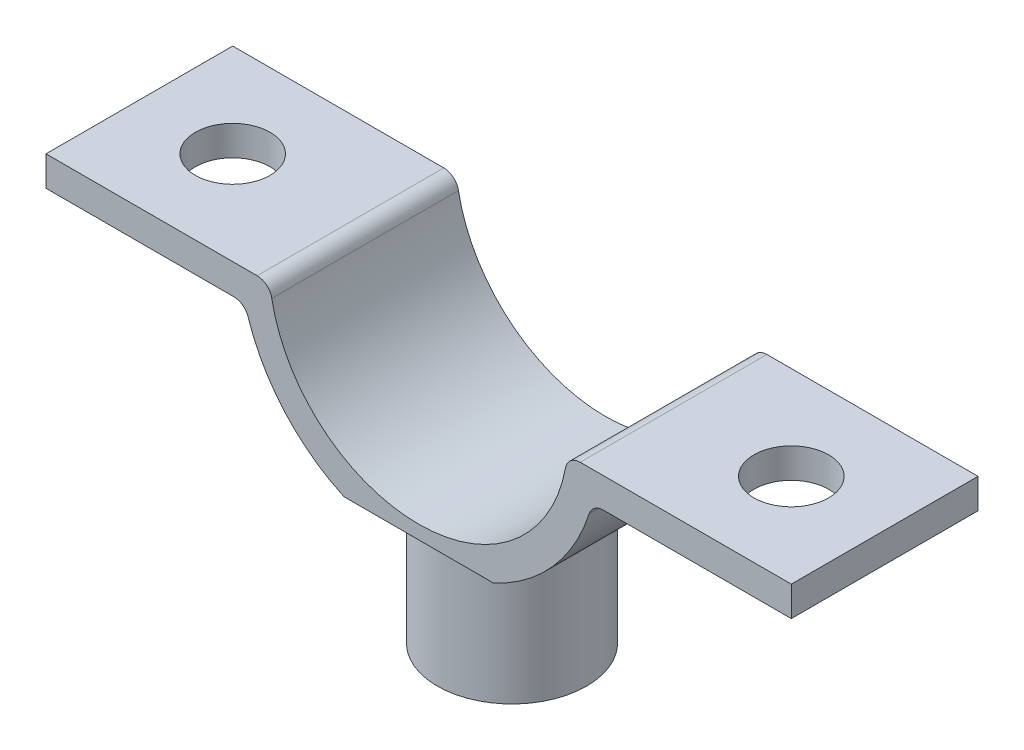
ISO-10303-21;
HEADER;
FILE_DESCRIPTION(('STEP AP214'),'2;1');
FILE_NAME('part.step','',(''),(''),'','','');
FILE_SCHEMA(('AUTOMOTIVE_DESIGN { 1 0 10303 214 1 1 1 1 }'));
ENDSEC;
DATA;
#1=APPLICATION_CONTEXT('core data for automotive mechanical design processes');
#2=APPLICATION_PROTOCOL_DEFINITION('international standard','automotive_design',2000,#1);
#3=PRODUCT_CONTEXT('',#1,'mechanical');
#4=PRODUCT('Part','Part','',(#3));
#5=PRODUCT_RELATED_PRODUCT_CATEGORY('part','',(#4));
#6=PRODUCT_DEFINITION_FORMATION('','',#4);
#7=PRODUCT_DEFINITION_CONTEXT('part definition',#1,'design');
#8=PRODUCT_DEFINITION('design','',#6,#7);
#9=PRODUCT_DEFINITION_SHAPE('','',#8);
#10=(LENGTH_UNIT() NAMED_UNIT(*) SI_UNIT(.MILLI.,.METRE.));
#11=(NAMED_UNIT(*) PLANE_ANGLE_UNIT() SI_UNIT($,.RADIAN.));
#12=(NAMED_UNIT(*) SI_UNIT($,.STERADIAN.) SOLID_ANGLE_UNIT());
#13=UNCERTAINTY_MEASURE_WITH_UNIT(LENGTH_MEASURE(1.E-05),#10,'distance_accuracy_value','');
#14=(GEOMETRIC_REPRESENTATION_CONTEXT(3) GLOBAL_UNCERTAINTY_ASSIGNED_CONTEXT((#13)) GLOBAL_UNIT_ASSIGNED_CONTEXT((#10,
#11,#12)) REPRESENTATION_CONTEXT('',''));
#15=CARTESIAN_POINT('',(0.,0.,0.));
#16=DIRECTION('',(0.,0.,1.));
#17=DIRECTION('',(1.,0.,0.));
#18=AXIS2_PLACEMENT_3D('',#15,#16,#17);
#19=CARTESIAN_POINT('',(12.369316876853,16.0173195198486,12.5));
#20=DIRECTION('',(0.,0.,-1.));
#21=DIRECTION('',(-1.,0.,0.));
#22=AXIS2_PLACEMENT_3D('',#19,#20,#21);
#23=CYLINDRICAL_SURFACE('',#22,1.);
#24=CARTESIAN_POINT('',(12.369316876853,16.0173195198486,0.));
#25=DIRECTION('',(0.,0.,-1.));
#26=DIRECTION('',(1.,0.,0.));
#27=AXIS2_PLACEMENT_3D('',#24,#25,#26);
#28=CIRCLE('',#27,1.);
#29=CARTESIAN_POINT('',(11.4178309632489,16.3250118275409,0.));
#30=VERTEX_POINT('',#29);
#31=CARTESIAN_POINT('',(12.369316876853,17.0173195198486,0.));
#32=VERTEX_POINT('',#31);
#33=EDGE_CURVE('E158',#30,#32,#28,.T.);
#34=ORIENTED_EDGE('',*,*,#33,.T.);
#35=DIRECTION('',(0.,0.,-1.));
#36=VECTOR('',#35,1.);
#37=CARTESIAN_POINT('',(12.369316876853,17.0173195198486,12.5));
#38=LINE('',#37,#36);
#39=CARTESIAN_POINT('',(12.369316876853,17.0173195198486,12.5));
#40=VERTEX_POINT('',#39);
#41=EDGE_CURVE('E156',#40,#32,#38,.T.);
#42=ORIENTED_EDGE('',*,*,#41,.F.);
#43=CARTESIAN_POINT('',(12.369316876853,16.0173195198486,12.5));
#44=DIRECTION('',(0.,0.,-1.));
#45=DIRECTION('',(1.,0.,0.));
#46=AXIS2_PLACEMENT_3D('',#43,#44,#45);
#47=CIRCLE('',#46,1.);
#48=CARTESIAN_POINT('',(11.4178309632489,16.3250118275409,12.5));
#49=VERTEX_POINT('',#48);
#50=EDGE_CURVE('E140',#49,#40,#47,.T.);
#51=ORIENTED_EDGE('',*,*,#50,.F.);
#52=DIRECTION('',(0.,0.,-1.));
#53=VECTOR('',#52,1.);
#54=CARTESIAN_POINT('',(11.4178309632489,16.3250118275409,12.5));
#55=LINE('',#54,#53);
#56=EDGE_CURVE('E160',#49,#30,#55,.T.);
#57=ORIENTED_EDGE('',*,*,#56,.T.);
#58=EDGE_LOOP('',(#34,#42,#51,#57));
#59=FACE_BOUND('',#58,.T.);
#60=ADVANCED_FACE('F38',(#59),#23,.F.);
#61=CARTESIAN_POINT('',(24.9498743710662,17.0173195198486,12.5));
#62=DIRECTION('',(0.,1.,0.));
#63=DIRECTION('',(0.,0.,1.));
#64=AXIS2_PLACEMENT_3D('',#61,#62,#63);
#65=PLANE('',#64);
#66=CARTESIAN_POINT('',(18.6998743710662,17.0173195198486,6.25));
#67=DIRECTION('',(0.,1.,0.));
#68=DIRECTION('',(0.,0.,1.));
#69=AXIS2_PLACEMENT_3D('',#66,#67,#68);
#70=CIRCLE('',#69,2.5);
#71=CARTESIAN_POINT('',(18.6998743710662,17.0173195198486,8.75));
#72=VERTEX_POINT('',#71);
#73=EDGE_CURVE('E283',#72,#72,#70,.F.);
#74=ORIENTED_EDGE('',*,*,#73,.F.);
#75=EDGE_LOOP('',(#74));
#76=FACE_BOUND('',#75,.T.);
#77=DIRECTION('',(1.,0.,0.));
#78=VECTOR('',#77,1.);
#79=CARTESIAN_POINT('',(24.9498743710662,17.0173195198486,0.));
#80=LINE('',#79,#78);
#81=CARTESIAN_POINT('',(24.9498743710662,17.0173195198486,0.));
#82=VERTEX_POINT('',#81);
#83=EDGE_CURVE('E194',#32,#82,#80,.T.);
#84=ORIENTED_EDGE('',*,*,#83,.T.);
#85=DIRECTION('',(0.,0.,-1.));
#86=VECTOR('',#85,1.);
#87=CARTESIAN_POINT('',(24.9498743710662,17.0173195198486,12.5));
#88=LINE('',#87,#86);
#89=CARTESIAN_POINT('',(24.9498743710662,17.0173195198486,12.5));
#90=VERTEX_POINT('',#89);
#91=EDGE_CURVE('E161',#90,#82,#88,.T.);
#92=ORIENTED_EDGE('',*,*,#91,.F.);
#93=DIRECTION('',(1.,0.,0.));
#94=VECTOR('',#93,1.);
#95=CARTESIAN_POINT('',(19.9498743710662,17.0173195198486,12.5));
#96=LINE('',#95,#94);
#97=EDGE_CURVE('E145',#40,#90,#96,.T.);
#98=ORIENTED_EDGE('',*,*,#97,.F.);
#99=ORIENTED_EDGE('',*,*,#41,.T.);
#100=EDGE_LOOP('',(#84,#92,#98,#99));
#101=FACE_BOUND('',#100,.T.);
#102=ADVANCED_FACE('F163',(#76,#101),#65,.F.);
#103=CARTESIAN_POINT('',(24.9498743710662,19.0173195198486,12.5));
#104=DIRECTION('',(-1.,0.,0.));
#105=DIRECTION('',(0.,0.,1.));
#106=AXIS2_PLACEMENT_3D('',#103,#104,#105);
#107=PLANE('',#106);
#108=DIRECTION('',(0.,1.,0.));
#109=VECTOR('',#108,1.);
#110=CARTESIAN_POINT('',(24.9498743710662,19.0173195198486,0.));
#111=LINE('',#110,#109);
#112=CARTESIAN_POINT('',(24.9498743710662,19.0173195198486,0.));
#113=VERTEX_POINT('',#112);
#114=EDGE_CURVE('E196',#82,#113,#111,.T.);
#115=ORIENTED_EDGE('',*,*,#114,.T.);
#116=DIRECTION('',(0.,0.,-1.));
#117=VECTOR('',#116,1.);
#118=CARTESIAN_POINT('',(24.9498743710662,19.0173195198486,12.5));
#119=LINE('',#118,#117);
#120=CARTESIAN_POINT('',(24.9498743710662,19.0173195198486,12.5));
#121=VERTEX_POINT('',#120);
#122=EDGE_CURVE('E166',#121,#113,#119,.T.);
#123=ORIENTED_EDGE('',*,*,#122,.F.);
#124=DIRECTION('',(0.,1.,0.));
#125=VECTOR('',#124,1.);
#126=CARTESIAN_POINT('',(24.9498743710662,19.0173195198486,12.5));
#127=LINE('',#126,#125);
#128=EDGE_CURVE('E61',#90,#121,#127,.T.);
#129=ORIENTED_EDGE('',*,*,#128,.F.);
#130=ORIENTED_EDGE('',*,*,#91,.T.);
#131=EDGE_LOOP('',(#115,#123,#129,#130));
#132=FACE_BOUND('',#131,.T.);
#133=ADVANCED_FACE('F330',(#132),#107,.F.);
#134=CARTESIAN_POINT('',(10.816653826392,19.0173195198486,12.5));
#135=DIRECTION('',(0.,-1.,0.));
#136=DIRECTION('',(0.,0.,-1.));
#137=AXIS2_PLACEMENT_3D('',#134,#135,#136);
#138=PLANE('',#137);
#139=CARTESIAN_POINT('',(18.6998743710661,19.0173195198487,6.25));
#140=DIRECTION('',(0.,1.,0.));
#141=DIRECTION('',(1.,0.,0.));
#142=AXIS2_PLACEMENT_3D('',#139,#140,#141);
#143=CIRCLE('',#142,2.5);
#144=CARTESIAN_POINT('',(21.1998743710662,19.0173195198487,6.25));
#145=VERTEX_POINT('',#144);
#146=EDGE_CURVE('E287',#145,#145,#143,.T.);
#147=ORIENTED_EDGE('',*,*,#146,.F.);
#148=EDGE_LOOP('',(#147));
#149=FACE_BOUND('',#148,.T.);
#150=DIRECTION('',(-1.,0.,0.));
#151=VECTOR('',#150,1.);
#152=CARTESIAN_POINT('',(10.816653826392,19.0173195198486,0.));
#153=LINE('',#152,#151);
#154=CARTESIAN_POINT('',(10.816653826392,19.0173195198486,0.));
#155=VERTEX_POINT('',#154);
#156=EDGE_CURVE('E106',#113,#155,#153,.T.);
#157=ORIENTED_EDGE('',*,*,#156,.T.);
#158=DIRECTION('',(0.,0.,-1.));
#159=VECTOR('',#158,1.);
#160=CARTESIAN_POINT('',(10.816653826392,19.0173195198486,12.5));
#161=LINE('',#160,#159);
#162=CARTESIAN_POINT('',(10.816653826392,19.0173195198486,12.5));
#163=VERTEX_POINT('',#162);
#164=EDGE_CURVE('E46',#163,#155,#161,.T.);
#165=ORIENTED_EDGE('',*,*,#164,.F.);
#166=DIRECTION('',(-1.,0.,0.));
#167=VECTOR('',#166,1.);
#168=CARTESIAN_POINT('',(19.9498743710662,19.0173195198486,12.5));
#169=LINE('',#168,#167);
#170=EDGE_CURVE('E112',#121,#163,#169,.T.);
#171=ORIENTED_EDGE('',*,*,#170,.F.);
#172=ORIENTED_EDGE('',*,*,#122,.T.);
#173=EDGE_LOOP('',(#157,#165,#171,#172));
#174=FACE_BOUND('',#173,.T.);
#175=ADVANCED_FACE('F40',(#149,#174),#138,.F.);
#176=CARTESIAN_POINT('',(10.816653826392,18.0173195198486,12.5));
#177=DIRECTION('',(0.,0.,-1.));
#178=DIRECTION('',(-1.,0.,0.));
#179=AXIS2_PLACEMENT_3D('',#176,#177,#178);
#180=CYLINDRICAL_SURFACE('',#179,1.);
#181=CARTESIAN_POINT('',(10.816653826392,18.0173195198486,0.));
#182=DIRECTION('',(0.,0.,1.));
#183=DIRECTION('',(1.,0.,0.));
#184=AXIS2_PLACEMENT_3D('',#181,#182,#183);
#185=CIRCLE('',#184,1.);
#186=CARTESIAN_POINT('',(9.83332166035634,18.1991377016668,0.));
#187=VERTEX_POINT('',#186);
#188=EDGE_CURVE('E171',#155,#187,#185,.T.);
#189=ORIENTED_EDGE('',*,*,#188,.T.);
#190=DIRECTION('',(0.,0.,-1.));
#191=VECTOR('',#190,1.);
#192=CARTESIAN_POINT('',(9.83332166035634,18.1991377016668,12.5));
#193=LINE('',#192,#191);
#194=CARTESIAN_POINT('',(9.83332166035634,18.1991377016668,12.5));
#195=VERTEX_POINT('',#194);
#196=EDGE_CURVE('E220',#195,#187,#193,.T.);
#197=ORIENTED_EDGE('',*,*,#196,.F.);
#198=CARTESIAN_POINT('',(10.816653826392,18.0173195198486,12.5));
#199=DIRECTION('',(0.,0.,1.));
#200=DIRECTION('',(1.,0.,0.));
#201=AXIS2_PLACEMENT_3D('',#198,#199,#200);
#202=CIRCLE('',#201,1.);
#203=EDGE_CURVE('E227',#163,#195,#202,.T.);
#204=ORIENTED_EDGE('',*,*,#203,.F.);
#205=ORIENTED_EDGE('',*,*,#164,.T.);
#206=EDGE_LOOP('',(#189,#197,#204,#205));
#207=FACE_BOUND('',#206,.T.);
#208=ADVANCED_FACE('F225',(#207),#180,.T.);
#209=CARTESIAN_POINT('',(0.,20.0173195198486,12.5));
#210=DIRECTION('',(0.,0.,-1.));
#211=DIRECTION('',(-1.,0.,0.));
#212=AXIS2_PLACEMENT_3D('',#209,#210,#211);
#213=CYLINDRICAL_SURFACE('',#212,10.);
#214=CARTESIAN_POINT('',(0.,20.0173195198486,0.));
#215=DIRECTION('',(0.,0.,-1.));
#216=DIRECTION('',(1.,0.,0.));
#217=AXIS2_PLACEMENT_3D('',#214,#215,#216);
#218=CIRCLE('',#217,10.);
#219=CARTESIAN_POINT('',(-9.83332166035634,18.1991377016668,0.));
#220=VERTEX_POINT('',#219);
#221=EDGE_CURVE('E174',#187,#220,#218,.T.);
#222=ORIENTED_EDGE('',*,*,#221,.T.);
#223=DIRECTION('',(0.,0.,-1.));
#224=VECTOR('',#223,1.);
#225=CARTESIAN_POINT('',(-9.83332166035634,18.1991377016668,12.5));
#226=LINE('',#225,#224);
#227=CARTESIAN_POINT('',(-9.83332166035634,18.1991377016668,12.5));
#228=VERTEX_POINT('',#227);
#229=EDGE_CURVE('E217',#228,#220,#226,.T.);
#230=ORIENTED_EDGE('',*,*,#229,.F.);
#231=CARTESIAN_POINT('',(0.,20.0173195198486,12.5));
#232=DIRECTION('',(0.,0.,-1.));
#233=DIRECTION('',(1.,0.,0.));
#234=AXIS2_PLACEMENT_3D('',#231,#232,#233);
#235=CIRCLE('',#234,10.);
#236=EDGE_CURVE('E243',#195,#228,#235,.T.);
#237=ORIENTED_EDGE('',*,*,#236,.F.);
#238=ORIENTED_EDGE('',*,*,#196,.T.);
#239=EDGE_LOOP('',(#222,#230,#237,#238));
#240=FACE_BOUND('',#239,.T.);
#241=ADVANCED_FACE('F234',(#240),#213,.F.);
#242=CARTESIAN_POINT('',(-10.816653826392,18.0173195198486,12.5));
#243=DIRECTION('',(0.,0.,-1.));
#244=DIRECTION('',(-1.,0.,0.));
#245=AXIS2_PLACEMENT_3D('',#242,#243,#244);
#246=CYLINDRICAL_SURFACE('',#245,1.);
#247=CARTESIAN_POINT('',(-10.816653826392,18.0173195198486,0.));
#248=DIRECTION('',(0.,0.,1.));
#249=DIRECTION('',(-1.,0.,0.));
#250=AXIS2_PLACEMENT_3D('',#247,#248,#249);
#251=CIRCLE('',#250,1.);
#252=CARTESIAN_POINT('',(-10.816653826392,19.0173195198486,0.));
#253=VERTEX_POINT('',#252);
#254=EDGE_CURVE('E176',#220,#253,#251,.T.);
#255=ORIENTED_EDGE('',*,*,#254,.T.);
#256=DIRECTION('',(0.,0.,-1.));
#257=VECTOR('',#256,1.);
#258=CARTESIAN_POINT('',(-10.816653826392,19.0173195198486,12.5));
#259=LINE('',#258,#257);
#260=CARTESIAN_POINT('',(-10.816653826392,19.0173195198486,12.5));
#261=VERTEX_POINT('',#260);
#262=EDGE_CURVE('E214',#261,#253,#259,.T.);
#263=ORIENTED_EDGE('',*,*,#262,.F.);
#264=CARTESIAN_POINT('',(-10.816653826392,18.0173195198486,12.5));
#265=DIRECTION('',(0.,0.,1.));
#266=DIRECTION('',(-1.,0.,0.));
#267=AXIS2_PLACEMENT_3D('',#264,#265,#266);
#268=CIRCLE('',#267,1.);
#269=EDGE_CURVE('E240',#228,#261,#268,.T.);
#270=ORIENTED_EDGE('',*,*,#269,.F.);
#271=ORIENTED_EDGE('',*,*,#229,.T.);
#272=EDGE_LOOP('',(#255,#263,#270,#271));
#273=FACE_BOUND('',#272,.T.);
#274=ADVANCED_FACE('F238',(#273),#246,.T.);
#275=CARTESIAN_POINT('',(-19.9498743710662,19.0173195198486,12.5));
#276=DIRECTION('',(0.,-1.,0.));
#277=DIRECTION('',(1.,0.,0.));
#278=AXIS2_PLACEMENT_3D('',#275,#276,#277);
#279=PLANE('',#278);
#280=CARTESIAN_POINT('',(-18.6998743710662,19.0173195198486,6.25));
#281=DIRECTION('',(0.,1.,0.));
#282=DIRECTION('',(-1.,0.,0.));
#283=AXIS2_PLACEMENT_3D('',#280,#281,#282);
#284=CIRCLE('',#283,2.5);
#285=CARTESIAN_POINT('',(-21.1998743710662,19.0173195198486,6.25));
#286=VERTEX_POINT('',#285);
#287=EDGE_CURVE('E286',#286,#286,#284,.T.);
#288=ORIENTED_EDGE('',*,*,#287,.F.);
#289=EDGE_LOOP('',(#288));
#290=FACE_BOUND('',#289,.T.);
#291=DIRECTION('',(-1.,0.,0.));
#292=VECTOR('',#291,1.);
#293=CARTESIAN_POINT('',(-19.9498743710662,19.0173195198486,0.));
#294=LINE('',#293,#292);
#295=CARTESIAN_POINT('',(-24.9498743710662,19.0173195198486,0.));
#296=VERTEX_POINT('',#295);
#297=EDGE_CURVE('E179',#253,#296,#294,.T.);
#298=ORIENTED_EDGE('',*,*,#297,.T.);
#299=DIRECTION('',(0.,0.,-1.));
#300=VECTOR('',#299,1.);
#301=CARTESIAN_POINT('',(-24.9498743710662,19.0173195198486,12.5));
#302=LINE('',#301,#300);
#303=CARTESIAN_POINT('',(-24.9498743710662,19.0173195198486,12.5));
#304=VERTEX_POINT('',#303);
#305=EDGE_CURVE('E211',#304,#296,#302,.T.);
#306=ORIENTED_EDGE('',*,*,#305,.F.);
#307=DIRECTION('',(-1.,0.,0.));
#308=VECTOR('',#307,1.);
#309=CARTESIAN_POINT('',(-10.816653826392,19.0173195198486,12.5));
#310=LINE('',#309,#308);
#311=EDGE_CURVE('E242',#261,#304,#310,.T.);
#312=ORIENTED_EDGE('',*,*,#311,.F.);
#313=ORIENTED_EDGE('',*,*,#262,.T.);
#314=EDGE_LOOP('',(#298,#306,#312,#313));
#315=FACE_BOUND('',#314,.T.);
#316=ADVANCED_FACE('F298',(#290,#315),#279,.F.);
#317=CARTESIAN_POINT('',(-24.9498743710662,19.0173195198486,12.5));
#318=DIRECTION('',(1.,0.,0.));
#319=DIRECTION('',(0.,0.,-1.));
#320=AXIS2_PLACEMENT_3D('',#317,#318,#319);
#321=PLANE('',#320);
#322=DIRECTION('',(0.,-1.,0.));
#323=VECTOR('',#322,1.);
#324=CARTESIAN_POINT('',(-24.9498743710662,19.0173195198486,0.));
#325=LINE('',#324,#323);
#326=CARTESIAN_POINT('',(-24.9498743710662,17.0173195198486,0.));
#327=VERTEX_POINT('',#326);
#328=EDGE_CURVE('E181',#296,#327,#325,.T.);
#329=ORIENTED_EDGE('',*,*,#328,.T.);
#330=DIRECTION('',(0.,0.,-1.));
#331=VECTOR('',#330,1.);
#332=CARTESIAN_POINT('',(-24.9498743710662,17.0173195198486,12.5));
#333=LINE('',#332,#331);
#334=CARTESIAN_POINT('',(-24.9498743710662,17.0173195198486,12.5));
#335=VERTEX_POINT('',#334);
#336=EDGE_CURVE('E208',#335,#327,#333,.T.);
#337=ORIENTED_EDGE('',*,*,#336,.F.);
#338=DIRECTION('',(0.,-1.,0.));
#339=VECTOR('',#338,1.);
#340=CARTESIAN_POINT('',(-24.9498743710662,19.0173195198486,12.5));
#341=LINE('',#340,#339);
#342=EDGE_CURVE('E245',#304,#335,#341,.T.);
#343=ORIENTED_EDGE('',*,*,#342,.F.);
#344=ORIENTED_EDGE('',*,*,#305,.T.);
#345=EDGE_LOOP('',(#329,#337,#343,#344));
#346=FACE_BOUND('',#345,.T.);
#347=ADVANCED_FACE('F301',(#346),#321,.F.);
#348=CARTESIAN_POINT('',(-19.9498743710662,17.0173195198486,12.5));
#349=DIRECTION('',(0.,1.,0.));
#350=DIRECTION('',(0.,0.,1.));
#351=AXIS2_PLACEMENT_3D('',#348,#349,#350);
#352=PLANE('',#351);
#353=CARTESIAN_POINT('',(-18.6998743710662,17.0173195198486,6.25));
#354=DIRECTION('',(0.,1.,0.));
#355=DIRECTION('',(0.,0.,1.));
#356=AXIS2_PLACEMENT_3D('',#353,#354,#355);
#357=CIRCLE('',#356,2.5);
#358=CARTESIAN_POINT('',(-18.6998743710662,17.0173195198486,8.75));
#359=VERTEX_POINT('',#358);
#360=EDGE_CURVE('E280',#359,#359,#357,.F.);
#361=ORIENTED_EDGE('',*,*,#360,.F.);
#362=EDGE_LOOP('',(#361));
#363=FACE_BOUND('',#362,.T.);
#364=DIRECTION('',(1.,0.,0.));
#365=VECTOR('',#364,1.);
#366=CARTESIAN_POINT('',(-19.9498743710662,17.0173195198486,0.));
#367=LINE('',#366,#365);
#368=CARTESIAN_POINT('',(-12.369316876853,17.0173195198486,0.));
#369=VERTEX_POINT('',#368);
#370=EDGE_CURVE('E184',#327,#369,#367,.T.);
#371=ORIENTED_EDGE('',*,*,#370,.T.);
#372=DIRECTION('',(0.,0.,-1.));
#373=VECTOR('',#372,1.);
#374=CARTESIAN_POINT('',(-12.369316876853,17.0173195198486,12.5));
#375=LINE('',#374,#373);
#376=CARTESIAN_POINT('',(-12.369316876853,17.0173195198486,12.5));
#377=VERTEX_POINT('',#376);
#378=EDGE_CURVE('E205',#377,#369,#375,.T.);
#379=ORIENTED_EDGE('',*,*,#378,.F.);
#380=DIRECTION('',(1.,0.,0.));
#381=VECTOR('',#380,1.);
#382=CARTESIAN_POINT('',(-24.9498743710662,17.0173195198486,12.5));
#383=LINE('',#382,#381);
#384=EDGE_CURVE('E251',#335,#377,#383,.T.);
#385=ORIENTED_EDGE('',*,*,#384,.F.);
#386=ORIENTED_EDGE('',*,*,#336,.T.);
#387=EDGE_LOOP('',(#371,#379,#385,#386));
#388=FACE_BOUND('',#387,.T.);
#389=ADVANCED_FACE('F311',(#363,#388),#352,.F.);
#390=CARTESIAN_POINT('',(-12.369316876853,16.0173195198486,12.5));
#391=DIRECTION('',(0.,0.,-1.));
#392=DIRECTION('',(-1.,0.,0.));
#393=AXIS2_PLACEMENT_3D('',#390,#391,#392);
#394=CYLINDRICAL_SURFACE('',#393,1.);
#395=CARTESIAN_POINT('',(-12.369316876853,16.0173195198486,0.));
#396=DIRECTION('',(0.,0.,-1.));
#397=DIRECTION('',(-1.,0.,0.));
#398=AXIS2_PLACEMENT_3D('',#395,#396,#397);
#399=CIRCLE('',#398,1.);
#400=CARTESIAN_POINT('',(-11.4178309632489,16.3250118275409,0.));
#401=VERTEX_POINT('',#400);
#402=EDGE_CURVE('E186',#369,#401,#399,.T.);
#403=ORIENTED_EDGE('',*,*,#402,.T.);
#404=DIRECTION('',(0.,0.,-1.));
#405=VECTOR('',#404,1.);
#406=CARTESIAN_POINT('',(-11.4178309632489,16.3250118275409,12.5));
#407=LINE('',#406,#405);
#408=CARTESIAN_POINT('',(-11.4178309632489,16.3250118275409,12.5));
#409=VERTEX_POINT('',#408);
#410=EDGE_CURVE('E202',#409,#401,#407,.T.);
#411=ORIENTED_EDGE('',*,*,#410,.F.);
#412=CARTESIAN_POINT('',(-12.369316876853,16.0173195198486,12.5));
#413=DIRECTION('',(0.,0.,-1.));
#414=DIRECTION('',(-1.,0.,0.));
#415=AXIS2_PLACEMENT_3D('',#412,#413,#414);
#416=CIRCLE('',#415,1.);
#417=EDGE_CURVE('E253',#377,#409,#416,.T.);
#418=ORIENTED_EDGE('',*,*,#417,.F.);
#419=ORIENTED_EDGE('',*,*,#378,.T.);
#420=EDGE_LOOP('',(#403,#411,#418,#419));
#421=FACE_BOUND('',#420,.T.);
#422=ADVANCED_FACE('F314',(#421),#394,.F.);
#423=CARTESIAN_POINT('',(12.369316876853,16.0173195198486,12.5));
#424=DIRECTION('',(0.,0.,1.));
#425=DIRECTION('',(1.,0.,0.));
#426=AXIS2_PLACEMENT_3D('',#423,#424,#425);
#427=PLANE('',#426);
#428=CARTESIAN_POINT('',(0.,20.0173195198486,12.5));
#429=DIRECTION('',(0.,0.,1.));
#430=DIRECTION('',(1.,0.,0.));
#431=AXIS2_PLACEMENT_3D('',#428,#429,#430);
#432=CIRCLE('',#431,12.);
#433=CARTESIAN_POINT('',(-5.0030371667547,9.11,12.5));
#434=VERTEX_POINT('',#433);
#435=EDGE_CURVE('E255',#409,#434,#432,.T.);
#436=ORIENTED_EDGE('',*,*,#435,.T.);
#437=DIRECTION('',(1.,0.,0.));
#438=VECTOR('',#437,1.);
#439=CARTESIAN_POINT('',(12.369316876853,9.11,12.5));
#440=LINE('',#439,#438);
#441=CARTESIAN_POINT('',(5.0030371667547,9.11,12.5));
#442=VERTEX_POINT('',#441);
#443=EDGE_CURVE('E172',#434,#442,#440,.T.);
#444=ORIENTED_EDGE('',*,*,#443,.T.);
#445=CARTESIAN_POINT('',(0.,20.0173195198486,12.5));
#446=DIRECTION('',(0.,0.,1.));
#447=DIRECTION('',(1.,0.,0.));
#448=AXIS2_PLACEMENT_3D('',#445,#446,#447);
#449=CIRCLE('',#448,12.);
#450=EDGE_CURVE('E149',#442,#49,#449,.T.);
#451=ORIENTED_EDGE('',*,*,#450,.T.);
#452=ORIENTED_EDGE('',*,*,#50,.T.);
#453=ORIENTED_EDGE('',*,*,#97,.T.);
#454=ORIENTED_EDGE('',*,*,#128,.T.);
#455=ORIENTED_EDGE('',*,*,#170,.T.);
#456=ORIENTED_EDGE('',*,*,#203,.T.);
#457=ORIENTED_EDGE('',*,*,#236,.T.);
#458=ORIENTED_EDGE('',*,*,#269,.T.);
#459=ORIENTED_EDGE('',*,*,#311,.T.);
#460=ORIENTED_EDGE('',*,*,#342,.T.);
#461=ORIENTED_EDGE('',*,*,#384,.T.);
#462=ORIENTED_EDGE('',*,*,#417,.T.);
#463=EDGE_LOOP('',(#436,#444,#451,#452,#453,#454,#455,#456,#457,#458,#459,#460,#461,#462));
#464=FACE_BOUND('',#463,.T.);
#465=ADVANCED_FACE('F143',(#464),#427,.T.);
#466=CARTESIAN_POINT('',(12.369316876853,16.0173195198486,0.));
#467=DIRECTION('',(0.,0.,1.));
#468=DIRECTION('',(1.,0.,0.));
#469=AXIS2_PLACEMENT_3D('',#466,#467,#468);
#470=PLANE('',#469);
#471=DIRECTION('',(1.,0.,0.));
#472=VECTOR('',#471,1.);
#473=CARTESIAN_POINT('',(12.369316876853,9.11,0.));
#474=LINE('',#473,#472);
#475=CARTESIAN_POINT('',(-5.0030371667547,9.11,0.));
#476=VERTEX_POINT('',#475);
#477=CARTESIAN_POINT('',(5.0030371667547,9.11,0.));
#478=VERTEX_POINT('',#477);
#479=EDGE_CURVE('E12',#476,#478,#474,.T.);
#480=ORIENTED_EDGE('',*,*,#479,.F.);
#481=CARTESIAN_POINT('',(0.,20.0173195198486,0.));
#482=DIRECTION('',(0.,0.,1.));
#483=DIRECTION('',(1.,0.,0.));
#484=AXIS2_PLACEMENT_3D('',#481,#482,#483);
#485=CIRCLE('',#484,12.);
#486=EDGE_CURVE('E188',#401,#476,#485,.T.);
#487=ORIENTED_EDGE('',*,*,#486,.F.);
#488=ORIENTED_EDGE('',*,*,#402,.F.);
#489=ORIENTED_EDGE('',*,*,#370,.F.);
#490=ORIENTED_EDGE('',*,*,#328,.F.);
#491=ORIENTED_EDGE('',*,*,#297,.F.);
#492=ORIENTED_EDGE('',*,*,#254,.F.);
#493=ORIENTED_EDGE('',*,*,#221,.F.);
#494=ORIENTED_EDGE('',*,*,#188,.F.);
#495=ORIENTED_EDGE('',*,*,#156,.F.);
#496=ORIENTED_EDGE('',*,*,#114,.F.);
#497=ORIENTED_EDGE('',*,*,#83,.F.);
#498=ORIENTED_EDGE('',*,*,#33,.F.);
#499=CARTESIAN_POINT('',(0.,20.0173195198486,0.));
#500=DIRECTION('',(0.,0.,1.));
#501=DIRECTION('',(1.,0.,0.));
#502=AXIS2_PLACEMENT_3D('',#499,#500,#501);
#503=CIRCLE('',#502,12.);
#504=EDGE_CURVE('E191',#478,#30,#503,.T.);
#505=ORIENTED_EDGE('',*,*,#504,.F.);
#506=EDGE_LOOP('',(#480,#487,#488,#489,#490,#491,#492,#493,#494,#495,#496,#497,#498,#505));
#507=FACE_BOUND('',#506,.T.);
#508=ADVANCED_FACE('F230',(#507),#470,.F.);
#509=CARTESIAN_POINT('',(0.,20.0173195198486,12.5));
#510=DIRECTION('',(0.,0.,-1.));
#511=DIRECTION('',(-1.,0.,0.));
#512=AXIS2_PLACEMENT_3D('',#509,#510,#511);
#513=CYLINDRICAL_SURFACE('',#512,12.);
#514=DIRECTION('',(0.,0.,-1.));
#515=VECTOR('',#514,1.);
#516=CARTESIAN_POINT('',(5.0030371667547,9.11,12.5));
#517=LINE('',#516,#515);
#518=EDGE_CURVE('E263',#478,#442,#517,.F.);
#519=ORIENTED_EDGE('',*,*,#518,.F.);
#520=ORIENTED_EDGE('',*,*,#504,.T.);
#521=ORIENTED_EDGE('',*,*,#56,.F.);
#522=ORIENTED_EDGE('',*,*,#450,.F.);
#523=EDGE_LOOP('',(#519,#520,#521,#522));
#524=FACE_BOUND('',#523,.T.);
#525=ADVANCED_FACE('F335',(#524),#513,.T.);
#526=CARTESIAN_POINT('',(0.,20.0173195198486,12.5));
#527=DIRECTION('',(0.,0.,-1.));
#528=DIRECTION('',(-1.,0.,0.));
#529=AXIS2_PLACEMENT_3D('',#526,#527,#528);
#530=CYLINDRICAL_SURFACE('',#529,12.);
#531=DIRECTION('',(0.,0.,-1.));
#532=VECTOR('',#531,1.);
#533=CARTESIAN_POINT('',(-5.0030371667547,9.11,12.5));
#534=LINE('',#533,#532);
#535=EDGE_CURVE('E52',#434,#476,#534,.T.);
#536=ORIENTED_EDGE('',*,*,#535,.F.);
#537=ORIENTED_EDGE('',*,*,#435,.F.);
#538=ORIENTED_EDGE('',*,*,#410,.T.);
#539=ORIENTED_EDGE('',*,*,#486,.T.);
#540=EDGE_LOOP('',(#536,#537,#538,#539));
#541=FACE_BOUND('',#540,.T.);
#542=ADVANCED_FACE('F261',(#541),#530,.T.);
#543=CARTESIAN_POINT('',(0.,9.11,6.25));
#544=DIRECTION('',(0.,-1.,0.));
#545=DIRECTION('',(1.,0.,0.));
#546=AXIS2_PLACEMENT_3D('',#543,#544,#545);
#547=PLANE('',#546);
#548=ORIENTED_EDGE('',*,*,#535,.T.);
#549=ORIENTED_EDGE('',*,*,#479,.T.);
#550=ORIENTED_EDGE('',*,*,#518,.T.);
#551=ORIENTED_EDGE('',*,*,#443,.F.);
#552=EDGE_LOOP('',(#548,#549,#550,#551));
#553=FACE_BOUND('',#552,.T.);
#554=CARTESIAN_POINT('',(0.,9.11,6.25));
#555=DIRECTION('',(0.,-1.,0.));
#556=DIRECTION('',(1.,0.,0.));
#557=AXIS2_PLACEMENT_3D('',#554,#555,#556);
#558=CIRCLE('',#557,4.99999999999773);
#559=CARTESIAN_POINT('',(4.99999999999773,9.11,6.25));
#560=VERTEX_POINT('',#559);
#561=EDGE_CURVE('E267',#560,#560,#558,.T.);
#562=ORIENTED_EDGE('',*,*,#561,.F.);
#563=EDGE_LOOP('',(#562));
#564=FACE_BOUND('',#563,.T.);
#565=ADVANCED_FACE('F345',(#553,#564),#547,.T.);
#566=CARTESIAN_POINT('',(0.,9.11,6.25));
#567=DIRECTION('',(0.,-1.,0.));
#568=DIRECTION('',(1.,0.,0.));
#569=AXIS2_PLACEMENT_3D('',#566,#567,#568);
#570=CYLINDRICAL_SURFACE('',#569,4.99999999999773);
#571=CARTESIAN_POINT('',(0.,0.,6.25));
#572=DIRECTION('',(0.,-1.,0.));
#573=DIRECTION('',(1.,0.,0.));
#574=AXIS2_PLACEMENT_3D('',#571,#572,#573);
#575=CIRCLE('',#574,4.99999999999773);
#576=CARTESIAN_POINT('',(4.99999999999773,0.,6.25));
#577=VERTEX_POINT('',#576);
#578=EDGE_CURVE('E271',#577,#577,#575,.T.);
#579=ORIENTED_EDGE('',*,*,#578,.F.);
#580=EDGE_LOOP('',(#579));
#581=FACE_BOUND('',#580,.T.);
#582=ORIENTED_EDGE('',*,*,#561,.T.);
#583=EDGE_LOOP('',(#582));
#584=FACE_BOUND('',#583,.T.);
#585=ADVANCED_FACE('F342',(#581,#584),#570,.T.);
#586=CARTESIAN_POINT('',(4.99999999999773,0.,12.5));
#587=DIRECTION('',(0.,1.,0.));
#588=DIRECTION('',(-1.,0.,0.));
#589=AXIS2_PLACEMENT_3D('',#586,#587,#588);
#590=PLANE('',#589);
#591=CARTESIAN_POINT('',(0.,0.,6.25));
#592=DIRECTION('',(0.,-1.,0.));
#593=DIRECTION('',(1.,0.,0.));
#594=AXIS2_PLACEMENT_3D('',#591,#592,#593);
#595=CIRCLE('',#594,3.);
#596=CARTESIAN_POINT('',(3.,0.,6.25));
#597=VERTEX_POINT('',#596);
#598=EDGE_CURVE('E277',#597,#597,#595,.T.);
#599=ORIENTED_EDGE('',*,*,#598,.F.);
#600=EDGE_LOOP('',(#599));
#601=FACE_BOUND('',#600,.T.);
#602=ORIENTED_EDGE('',*,*,#578,.T.);
#603=EDGE_LOOP('',(#602));
#604=FACE_BOUND('',#603,.T.);
#605=ADVANCED_FACE('F339',(#601,#604),#590,.F.);
#606=CARTESIAN_POINT('',(0.,9.11,6.25));
#607=DIRECTION('',(0.,-1.,0.));
#608=DIRECTION('',(1.,0.,0.));
#609=AXIS2_PLACEMENT_3D('',#606,#607,#608);
#610=CYLINDRICAL_SURFACE('',#609,3.);
#611=CARTESIAN_POINT('',(0.,9.11,6.25));
#612=DIRECTION('',(0.,-1.,0.));
#613=DIRECTION('',(1.,0.,0.));
#614=AXIS2_PLACEMENT_3D('',#611,#612,#613);
#615=CIRCLE('',#614,3.);
#616=CARTESIAN_POINT('',(3.,9.11,6.25));
#617=VERTEX_POINT('',#616);
#618=EDGE_CURVE('E274',#617,#617,#615,.T.);
#619=ORIENTED_EDGE('',*,*,#618,.F.);
#620=EDGE_LOOP('',(#619));
#621=FACE_BOUND('',#620,.T.);
#622=ORIENTED_EDGE('',*,*,#598,.T.);
#623=EDGE_LOOP('',(#622));
#624=FACE_BOUND('',#623,.T.);
#625=ADVANCED_FACE('F341',(#621,#624),#610,.F.);
#626=CARTESIAN_POINT('',(0.,9.11,6.25));
#627=DIRECTION('',(0.,-1.,0.));
#628=DIRECTION('',(1.,0.,0.));
#629=AXIS2_PLACEMENT_3D('',#626,#627,#628);
#630=PLANE('',#629);
#631=ORIENTED_EDGE('',*,*,#618,.T.);
#632=EDGE_LOOP('',(#631));
#633=FACE_BOUND('',#632,.T.);
#634=ADVANCED_FACE('F382',(#633),#630,.T.);
#635=CARTESIAN_POINT('',(-18.6998743710662,-0.00100000000005998,6.25));
#636=DIRECTION('',(0.,1.,0.));
#637=DIRECTION('',(-1.,0.,0.));
#638=AXIS2_PLACEMENT_3D('',#635,#636,#637);
#639=CYLINDRICAL_SURFACE('',#638,2.5);
#640=ORIENTED_EDGE('',*,*,#287,.T.);
#641=EDGE_LOOP('',(#640));
#642=FACE_BOUND('',#641,.T.);
#643=ORIENTED_EDGE('',*,*,#360,.T.);
#644=EDGE_LOOP('',(#643));
#645=FACE_BOUND('',#644,.T.);
#646=ADVANCED_FACE('F295',(#642,#645),#639,.F.);
#647=CARTESIAN_POINT('',(18.6998743710662,-0.00100000000001141,6.25));
#648=DIRECTION('',(0.,1.,0.));
#649=DIRECTION('',(-1.,0.,0.));
#650=AXIS2_PLACEMENT_3D('',#647,#648,#649);
#651=CYLINDRICAL_SURFACE('',#650,2.5);
#652=ORIENTED_EDGE('',*,*,#146,.T.);
#653=EDGE_LOOP('',(#652));
#654=FACE_BOUND('',#653,.T.);
#655=ORIENTED_EDGE('',*,*,#73,.T.);
#656=EDGE_LOOP('',(#655));
#657=FACE_BOUND('',#656,.T.);
#658=ADVANCED_FACE('F374',(#654,#657),#651,.F.);
#659=CLOSED_SHELL('',(#60,#102,#133,#175,#208,#241,#274,#316,#347,#389,#422,#465,#508,#525,#542,
#565,#585,#605,#625,#634,#646,#658));
#660=MANIFOLD_SOLID_BREP('B2',#659);
#661=ADVANCED_BREP_SHAPE_REPRESENTATION('',(#18,#660),#14);
#662=SHAPE_DEFINITION_REPRESENTATION(#9,#661);
ENDSEC;
END-ISO-10303-21;
